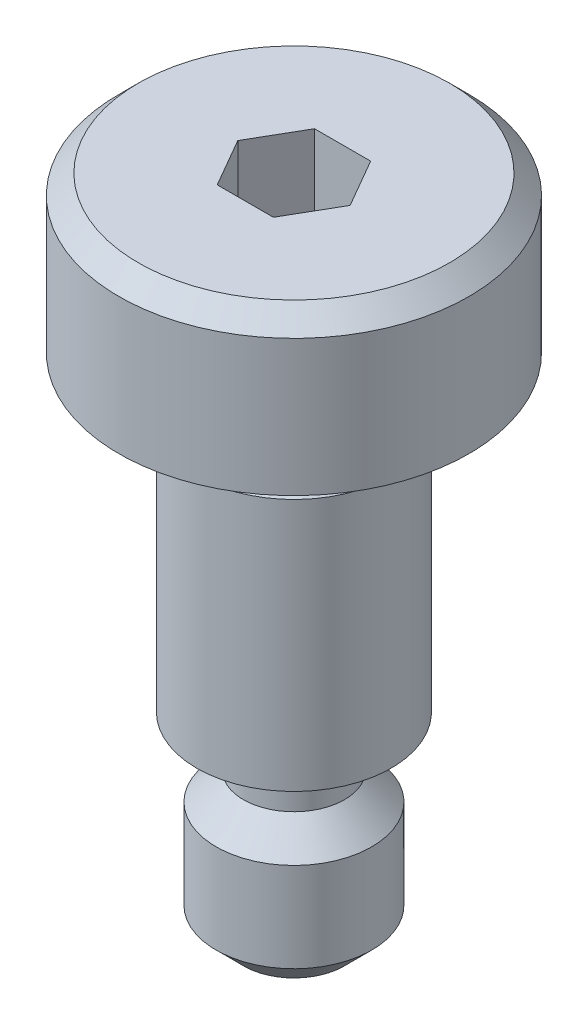
ISO-10303-21;
HEADER;
FILE_DESCRIPTION(('STEP AP214'),'2;1');
FILE_NAME('part.step','',(''),(''),'','','');
FILE_SCHEMA(('AUTOMOTIVE_DESIGN { 1 0 10303 214 1 1 1 1 }'));
ENDSEC;
DATA;
#1=APPLICATION_CONTEXT('core data for automotive mechanical design processes');
#2=APPLICATION_PROTOCOL_DEFINITION('international standard','automotive_design',2000,#1);
#3=PRODUCT_CONTEXT('',#1,'mechanical');
#4=PRODUCT('Part','Part','',(#3));
#5=PRODUCT_RELATED_PRODUCT_CATEGORY('part','',(#4));
#6=PRODUCT_DEFINITION_FORMATION('','',#4);
#7=PRODUCT_DEFINITION_CONTEXT('part definition',#1,'design');
#8=PRODUCT_DEFINITION('design','',#6,#7);
#9=PRODUCT_DEFINITION_SHAPE('','',#8);
#10=(LENGTH_UNIT() NAMED_UNIT(*) SI_UNIT(.MILLI.,.METRE.));
#11=(NAMED_UNIT(*) PLANE_ANGLE_UNIT() SI_UNIT($,.RADIAN.));
#12=(NAMED_UNIT(*) SI_UNIT($,.STERADIAN.) SOLID_ANGLE_UNIT());
#13=UNCERTAINTY_MEASURE_WITH_UNIT(LENGTH_MEASURE(1.E-05),#10,'distance_accuracy_value','');
#14=(GEOMETRIC_REPRESENTATION_CONTEXT(3) GLOBAL_UNCERTAINTY_ASSIGNED_CONTEXT((#13)) GLOBAL_UNIT_ASSIGNED_CONTEXT((#10,
#11,#12)) REPRESENTATION_CONTEXT('',''));
#15=CARTESIAN_POINT('',(0.,0.,0.));
#16=DIRECTION('',(0.,0.,1.));
#17=DIRECTION('',(1.,0.,0.));
#18=AXIS2_PLACEMENT_3D('',#15,#16,#17);
#19=CARTESIAN_POINT('',(1.3,0.,0.));
#20=DIRECTION('',(0.,-1.,0.));
#21=DIRECTION('',(0.,0.,-1.));
#22=AXIS2_PLACEMENT_3D('',#19,#20,#21);
#23=PLANE('',#22);
#24=CARTESIAN_POINT('',(0.,0.,0.));
#25=DIRECTION('',(0.,-1.,0.));
#26=DIRECTION('',(0.,0.,-1.));
#27=AXIS2_PLACEMENT_3D('',#24,#25,#26);
#28=CIRCLE('',#27,1.3);
#29=CARTESIAN_POINT('',(0.,0.,-1.3));
#30=VERTEX_POINT('',#29);
#31=EDGE_CURVE('E11',#30,#30,#28,.T.);
#32=ORIENTED_EDGE('',*,*,#31,.T.);
#33=EDGE_LOOP('',(#32));
#34=FACE_BOUND('',#33,.T.);
#35=ADVANCED_FACE('F34',(#34),#23,.T.);
#36=CARTESIAN_POINT('',(0.,0.,0.));
#37=DIRECTION('',(0.,1.,0.));
#38=DIRECTION('',(0.,0.,1.));
#39=AXIS2_PLACEMENT_3D('',#36,#37,#38);
#40=CONICAL_SURFACE('',#39,1.3,0.78539816339745);
#41=CARTESIAN_POINT('',(0.,0.699999999999997,0.));
#42=DIRECTION('',(0.,-1.,0.));
#43=DIRECTION('',(0.,0.,-1.));
#44=AXIS2_PLACEMENT_3D('',#41,#42,#43);
#45=CIRCLE('',#44,2.);
#46=CARTESIAN_POINT('',(0.,0.699999999999997,-2.));
#47=VERTEX_POINT('',#46);
#48=EDGE_CURVE('E41',#47,#47,#45,.T.);
#49=ORIENTED_EDGE('',*,*,#48,.T.);
#50=EDGE_LOOP('',(#49));
#51=FACE_BOUND('',#50,.T.);
#52=ORIENTED_EDGE('',*,*,#31,.F.);
#53=EDGE_LOOP('',(#52));
#54=FACE_BOUND('',#53,.T.);
#55=ADVANCED_FACE('F178',(#51,#54),#40,.T.);
#56=CARTESIAN_POINT('',(0.,0.,0.));
#57=DIRECTION('',(0.,-1.,0.));
#58=DIRECTION('',(0.,0.,-1.));
#59=AXIS2_PLACEMENT_3D('',#56,#57,#58);
#60=CYLINDRICAL_SURFACE('',#59,2.);
#61=CARTESIAN_POINT('',(0.,3.,0.));
#62=DIRECTION('',(0.,-1.,0.));
#63=DIRECTION('',(0.,0.,-1.));
#64=AXIS2_PLACEMENT_3D('',#61,#62,#63);
#65=CIRCLE('',#64,2.);
#66=CARTESIAN_POINT('',(0.,3.,-2.));
#67=VERTEX_POINT('',#66);
#68=EDGE_CURVE('E173',#67,#67,#65,.T.);
#69=ORIENTED_EDGE('',*,*,#68,.T.);
#70=EDGE_LOOP('',(#69));
#71=FACE_BOUND('',#70,.T.);
#72=ORIENTED_EDGE('',*,*,#48,.F.);
#73=EDGE_LOOP('',(#72));
#74=FACE_BOUND('',#73,.T.);
#75=ADVANCED_FACE('F181',(#71,#74),#60,.T.);
#76=CARTESIAN_POINT('',(0.,3.,0.));
#77=DIRECTION('',(0.,-1.,0.));
#78=DIRECTION('',(0.,0.,-1.));
#79=AXIS2_PLACEMENT_3D('',#76,#77,#78);
#80=CONICAL_SURFACE('',#79,2.,0.785398163397445);
#81=CARTESIAN_POINT('',(0.,3.7,0.));
#82=DIRECTION('',(0.,-1.,0.));
#83=DIRECTION('',(0.,0.,-1.));
#84=AXIS2_PLACEMENT_3D('',#81,#82,#83);
#85=CIRCLE('',#84,1.3);
#86=CARTESIAN_POINT('',(0.,3.7,-1.3));
#87=VERTEX_POINT('',#86);
#88=EDGE_CURVE('E170',#87,#87,#85,.T.);
#89=ORIENTED_EDGE('',*,*,#88,.T.);
#90=EDGE_LOOP('',(#89));
#91=FACE_BOUND('',#90,.T.);
#92=ORIENTED_EDGE('',*,*,#68,.F.);
#93=EDGE_LOOP('',(#92));
#94=FACE_BOUND('',#93,.T.);
#95=ADVANCED_FACE('F183',(#91,#94),#80,.T.);
#96=CARTESIAN_POINT('',(0.,0.,0.));
#97=DIRECTION('',(0.,-1.,0.));
#98=DIRECTION('',(0.,0.,-1.));
#99=AXIS2_PLACEMENT_3D('',#96,#97,#98);
#100=CYLINDRICAL_SURFACE('',#99,1.3);
#101=CARTESIAN_POINT('',(0.,4.3,0.));
#102=DIRECTION('',(0.,-1.,0.));
#103=DIRECTION('',(0.,0.,-1.));
#104=AXIS2_PLACEMENT_3D('',#101,#102,#103);
#105=CIRCLE('',#104,1.3);
#106=CARTESIAN_POINT('',(0.,4.3,-1.3));
#107=VERTEX_POINT('',#106);
#108=EDGE_CURVE('E167',#107,#107,#105,.T.);
#109=ORIENTED_EDGE('',*,*,#108,.T.);
#110=EDGE_LOOP('',(#109));
#111=FACE_BOUND('',#110,.T.);
#112=ORIENTED_EDGE('',*,*,#88,.F.);
#113=EDGE_LOOP('',(#112));
#114=FACE_BOUND('',#113,.T.);
#115=ADVANCED_FACE('F190',(#111,#114),#100,.T.);
#116=CARTESIAN_POINT('',(0.,4.3,0.));
#117=DIRECTION('',(0.,-1.,0.));
#118=DIRECTION('',(0.,0.,-1.));
#119=AXIS2_PLACEMENT_3D('',#116,#117,#118);
#120=TOROIDAL_SURFACE('',#119,2.,0.7);
#121=CARTESIAN_POINT('',(0.,5.,0.));
#122=DIRECTION('',(0.,-1.,0.));
#123=DIRECTION('',(0.,0.,-1.));
#124=AXIS2_PLACEMENT_3D('',#121,#122,#123);
#125=CIRCLE('',#124,2.);
#126=CARTESIAN_POINT('',(0.,5.,-2.));
#127=VERTEX_POINT('',#126);
#128=EDGE_CURVE('E164',#127,#127,#125,.T.);
#129=ORIENTED_EDGE('',*,*,#128,.T.);
#130=EDGE_LOOP('',(#129));
#131=FACE_BOUND('',#130,.T.);
#132=ORIENTED_EDGE('',*,*,#108,.F.);
#133=EDGE_LOOP('',(#132));
#134=FACE_BOUND('',#133,.T.);
#135=ADVANCED_FACE('F221',(#131,#134),#120,.F.);
#136=CARTESIAN_POINT('',(2.5,5.,0.));
#137=DIRECTION('',(0.,-1.,0.));
#138=DIRECTION('',(0.,0.,-1.));
#139=AXIS2_PLACEMENT_3D('',#136,#137,#138);
#140=PLANE('',#139);
#141=CARTESIAN_POINT('',(0.,5.,0.));
#142=DIRECTION('',(0.,-1.,0.));
#143=DIRECTION('',(0.,0.,-1.));
#144=AXIS2_PLACEMENT_3D('',#141,#142,#143);
#145=CIRCLE('',#144,2.5);
#146=CARTESIAN_POINT('',(0.,5.,-2.5));
#147=VERTEX_POINT('',#146);
#148=EDGE_CURVE('E161',#147,#147,#145,.T.);
#149=ORIENTED_EDGE('',*,*,#148,.T.);
#150=EDGE_LOOP('',(#149));
#151=FACE_BOUND('',#150,.T.);
#152=ORIENTED_EDGE('',*,*,#128,.F.);
#153=EDGE_LOOP('',(#152));
#154=FACE_BOUND('',#153,.T.);
#155=ADVANCED_FACE('F231',(#151,#154),#140,.T.);
#156=CARTESIAN_POINT('',(0.,0.,0.));
#157=DIRECTION('',(0.,-1.,0.));
#158=DIRECTION('',(0.,0.,-1.));
#159=AXIS2_PLACEMENT_3D('',#156,#157,#158);
#160=CYLINDRICAL_SURFACE('',#159,2.5);
#161=CARTESIAN_POINT('',(0.,11.5,0.));
#162=DIRECTION('',(0.,-1.,0.));
#163=DIRECTION('',(0.,0.,-1.));
#164=AXIS2_PLACEMENT_3D('',#161,#162,#163);
#165=CIRCLE('',#164,2.5);
#166=CARTESIAN_POINT('',(0.,11.5,-2.5));
#167=VERTEX_POINT('',#166);
#168=EDGE_CURVE('E158',#167,#167,#165,.T.);
#169=ORIENTED_EDGE('',*,*,#168,.T.);
#170=EDGE_LOOP('',(#169));
#171=FACE_BOUND('',#170,.T.);
#172=ORIENTED_EDGE('',*,*,#148,.F.);
#173=EDGE_LOOP('',(#172));
#174=FACE_BOUND('',#173,.T.);
#175=ADVANCED_FACE('F241',(#171,#174),#160,.T.);
#176=CARTESIAN_POINT('',(0.,11.5,0.));
#177=DIRECTION('',(0.,-1.,0.));
#178=DIRECTION('',(0.,0.,-1.));
#179=AXIS2_PLACEMENT_3D('',#176,#177,#178);
#180=CONICAL_SURFACE('',#179,2.5,0.785398163397445);
#181=CARTESIAN_POINT('',(0.,12.,0.));
#182=DIRECTION('',(0.,-1.,0.));
#183=DIRECTION('',(0.,0.,-1.));
#184=AXIS2_PLACEMENT_3D('',#181,#182,#183);
#185=CIRCLE('',#184,2.);
#186=CARTESIAN_POINT('',(0.,12.,-2.));
#187=VERTEX_POINT('',#186);
#188=EDGE_CURVE('E155',#187,#187,#185,.T.);
#189=ORIENTED_EDGE('',*,*,#188,.T.);
#190=EDGE_LOOP('',(#189));
#191=FACE_BOUND('',#190,.T.);
#192=ORIENTED_EDGE('',*,*,#168,.F.);
#193=EDGE_LOOP('',(#192));
#194=FACE_BOUND('',#193,.T.);
#195=ADVANCED_FACE('F251',(#191,#194),#180,.T.);
#196=CARTESIAN_POINT('',(0.,0.,0.));
#197=DIRECTION('',(0.,-1.,0.));
#198=DIRECTION('',(0.,0.,-1.));
#199=AXIS2_PLACEMENT_3D('',#196,#197,#198);
#200=CYLINDRICAL_SURFACE('',#199,2.);
#201=CARTESIAN_POINT('',(0.,12.5,0.));
#202=DIRECTION('',(0.,-1.,0.));
#203=DIRECTION('',(0.,0.,-1.));
#204=AXIS2_PLACEMENT_3D('',#201,#202,#203);
#205=CIRCLE('',#204,2.);
#206=CARTESIAN_POINT('',(0.,12.5,-2.));
#207=VERTEX_POINT('',#206);
#208=EDGE_CURVE('E152',#207,#207,#205,.T.);
#209=ORIENTED_EDGE('',*,*,#208,.T.);
#210=EDGE_LOOP('',(#209));
#211=FACE_BOUND('',#210,.T.);
#212=ORIENTED_EDGE('',*,*,#188,.F.);
#213=EDGE_LOOP('',(#212));
#214=FACE_BOUND('',#213,.T.);
#215=ADVANCED_FACE('F261',(#211,#214),#200,.T.);
#216=CARTESIAN_POINT('',(0.,12.5,0.));
#217=DIRECTION('',(0.,-1.,0.));
#218=DIRECTION('',(0.,0.,-1.));
#219=AXIS2_PLACEMENT_3D('',#216,#217,#218);
#220=TOROIDAL_SURFACE('',#219,2.5,0.5);
#221=CARTESIAN_POINT('',(0.,13.,0.));
#222=DIRECTION('',(0.,-1.,0.));
#223=DIRECTION('',(0.,0.,-1.));
#224=AXIS2_PLACEMENT_3D('',#221,#222,#223);
#225=CIRCLE('',#224,2.5);
#226=CARTESIAN_POINT('',(0.,13.,-2.5));
#227=VERTEX_POINT('',#226);
#228=EDGE_CURVE('E149',#227,#227,#225,.T.);
#229=ORIENTED_EDGE('',*,*,#228,.T.);
#230=EDGE_LOOP('',(#229));
#231=FACE_BOUND('',#230,.T.);
#232=ORIENTED_EDGE('',*,*,#208,.F.);
#233=EDGE_LOOP('',(#232));
#234=FACE_BOUND('',#233,.T.);
#235=ADVANCED_FACE('F271',(#231,#234),#220,.F.);
#236=CARTESIAN_POINT('',(4.5,13.,0.));
#237=DIRECTION('',(0.,-1.,0.));
#238=DIRECTION('',(0.,0.,-1.));
#239=AXIS2_PLACEMENT_3D('',#236,#237,#238);
#240=PLANE('',#239);
#241=CARTESIAN_POINT('',(0.,13.,0.));
#242=DIRECTION('',(0.,-1.,0.));
#243=DIRECTION('',(0.,0.,-1.));
#244=AXIS2_PLACEMENT_3D('',#241,#242,#243);
#245=CIRCLE('',#244,4.5);
#246=CARTESIAN_POINT('',(0.,13.,-4.5));
#247=VERTEX_POINT('',#246);
#248=EDGE_CURVE('E146',#247,#247,#245,.T.);
#249=ORIENTED_EDGE('',*,*,#248,.T.);
#250=EDGE_LOOP('',(#249));
#251=FACE_BOUND('',#250,.T.);
#252=ORIENTED_EDGE('',*,*,#228,.F.);
#253=EDGE_LOOP('',(#252));
#254=FACE_BOUND('',#253,.T.);
#255=ADVANCED_FACE('F281',(#251,#254),#240,.T.);
#256=CARTESIAN_POINT('',(0.,0.,0.));
#257=DIRECTION('',(0.,-1.,0.));
#258=DIRECTION('',(0.,0.,-1.));
#259=AXIS2_PLACEMENT_3D('',#256,#257,#258);
#260=CYLINDRICAL_SURFACE('',#259,4.5);
#261=CARTESIAN_POINT('',(0.,16.5,0.));
#262=DIRECTION('',(0.,-1.,0.));
#263=DIRECTION('',(0.,0.,-1.));
#264=AXIS2_PLACEMENT_3D('',#261,#262,#263);
#265=CIRCLE('',#264,4.5);
#266=CARTESIAN_POINT('',(0.,16.5,-4.5));
#267=VERTEX_POINT('',#266);
#268=EDGE_CURVE('E143',#267,#267,#265,.T.);
#269=ORIENTED_EDGE('',*,*,#268,.T.);
#270=EDGE_LOOP('',(#269));
#271=FACE_BOUND('',#270,.T.);
#272=ORIENTED_EDGE('',*,*,#248,.F.);
#273=EDGE_LOOP('',(#272));
#274=FACE_BOUND('',#273,.T.);
#275=ADVANCED_FACE('F291',(#271,#274),#260,.T.);
#276=CARTESIAN_POINT('',(0.,16.5,0.));
#277=DIRECTION('',(0.,-1.,0.));
#278=DIRECTION('',(0.,0.,-1.));
#279=AXIS2_PLACEMENT_3D('',#276,#277,#278);
#280=CONICAL_SURFACE('',#279,4.5,0.785398163397446);
#281=CARTESIAN_POINT('',(0.,17.,0.));
#282=DIRECTION('',(0.,-1.,0.));
#283=DIRECTION('',(0.,0.,-1.));
#284=AXIS2_PLACEMENT_3D('',#281,#282,#283);
#285=CIRCLE('',#284,4.);
#286=CARTESIAN_POINT('',(0.,17.,-4.));
#287=VERTEX_POINT('',#286);
#288=EDGE_CURVE('E135',#287,#287,#285,.T.);
#289=ORIENTED_EDGE('',*,*,#288,.T.);
#290=EDGE_LOOP('',(#289));
#291=FACE_BOUND('',#290,.T.);
#292=ORIENTED_EDGE('',*,*,#268,.F.);
#293=EDGE_LOOP('',(#292));
#294=FACE_BOUND('',#293,.T.);
#295=ADVANCED_FACE('F301',(#291,#294),#280,.T.);
#296=CARTESIAN_POINT('',(0.,17.,0.));
#297=DIRECTION('',(0.,1.,0.));
#298=DIRECTION('',(0.,0.,1.));
#299=AXIS2_PLACEMENT_3D('',#296,#297,#298);
#300=PLANE('',#299);
#301=DIRECTION('',(-0.5,0.,-0.866025403784438));
#302=VECTOR('',#301,1.);
#303=CARTESIAN_POINT('',(1.44337567297406,17.,0.));
#304=LINE('',#303,#302);
#305=CARTESIAN_POINT('',(1.44337567297406,17.,0.));
#306=VERTEX_POINT('',#305);
#307=CARTESIAN_POINT('',(0.721687836487032,17.,-1.25));
#308=VERTEX_POINT('',#307);
#309=EDGE_CURVE('E48',#306,#308,#304,.T.);
#310=ORIENTED_EDGE('',*,*,#309,.F.);
#311=DIRECTION('',(0.5,0.,-0.866025403784438));
#312=VECTOR('',#311,1.);
#313=CARTESIAN_POINT('',(0.721687836487032,17.,1.25));
#314=LINE('',#313,#312);
#315=CARTESIAN_POINT('',(0.721687836487032,17.,1.25));
#316=VERTEX_POINT('',#315);
#317=EDGE_CURVE('E131',#316,#306,#314,.T.);
#318=ORIENTED_EDGE('',*,*,#317,.F.);
#319=DIRECTION('',(1.,0.,0.));
#320=VECTOR('',#319,1.);
#321=CARTESIAN_POINT('',(-0.721687836487032,17.,1.25));
#322=LINE('',#321,#320);
#323=CARTESIAN_POINT('',(-0.721687836487032,17.,1.25));
#324=VERTEX_POINT('',#323);
#325=EDGE_CURVE('E129',#324,#316,#322,.T.);
#326=ORIENTED_EDGE('',*,*,#325,.F.);
#327=DIRECTION('',(0.5,0.,0.866025403784439));
#328=VECTOR('',#327,1.);
#329=CARTESIAN_POINT('',(-1.44337567297406,17.,0.));
#330=LINE('',#329,#328);
#331=CARTESIAN_POINT('',(-1.44337567297406,17.,0.));
#332=VERTEX_POINT('',#331);
#333=EDGE_CURVE('E96',#332,#324,#330,.T.);
#334=ORIENTED_EDGE('',*,*,#333,.F.);
#335=DIRECTION('',(-0.5,0.,0.866025403784439));
#336=VECTOR('',#335,1.);
#337=CARTESIAN_POINT('',(-0.721687836487032,17.,-1.25));
#338=LINE('',#337,#336);
#339=CARTESIAN_POINT('',(-0.721687836487032,17.,-1.25));
#340=VERTEX_POINT('',#339);
#341=EDGE_CURVE('E125',#340,#332,#338,.T.);
#342=ORIENTED_EDGE('',*,*,#341,.F.);
#343=DIRECTION('',(-1.,0.,0.));
#344=VECTOR('',#343,1.);
#345=CARTESIAN_POINT('',(0.721687836487032,17.,-1.25));
#346=LINE('',#345,#344);
#347=EDGE_CURVE('E122',#308,#340,#346,.T.);
#348=ORIENTED_EDGE('',*,*,#347,.F.);
#349=EDGE_LOOP('',(#310,#318,#326,#334,#342,#348));
#350=FACE_BOUND('',#349,.T.);
#351=ORIENTED_EDGE('',*,*,#288,.F.);
#352=EDGE_LOOP('',(#351));
#353=FACE_BOUND('',#352,.T.);
#354=ADVANCED_FACE('F311',(#350,#353),#300,.T.);
#355=CARTESIAN_POINT('',(1.44337567297406,14.,0.));
#356=DIRECTION('',(0.866025403784439,0.,-0.5));
#357=DIRECTION('',(-0.5,0.,-0.866025403784439));
#358=AXIS2_PLACEMENT_3D('',#355,#356,#357);
#359=PLANE('',#358);
#360=ORIENTED_EDGE('',*,*,#309,.T.);
#361=DIRECTION('',(0.,1.,0.));
#362=VECTOR('',#361,1.);
#363=CARTESIAN_POINT('',(0.721687836487032,14.,-1.25));
#364=LINE('',#363,#362);
#365=CARTESIAN_POINT('',(0.721687836487032,14.,-1.25));
#366=VERTEX_POINT('',#365);
#367=EDGE_CURVE('E78',#366,#308,#364,.T.);
#368=ORIENTED_EDGE('',*,*,#367,.F.);
#369=DIRECTION('',(-0.5,0.,-0.866025403784438));
#370=VECTOR('',#369,1.);
#371=CARTESIAN_POINT('',(1.44337567297406,14.,0.));
#372=LINE('',#371,#370);
#373=CARTESIAN_POINT('',(1.44337567297406,14.,0.));
#374=VERTEX_POINT('',#373);
#375=EDGE_CURVE('E133',#374,#366,#372,.T.);
#376=ORIENTED_EDGE('',*,*,#375,.F.);
#377=DIRECTION('',(0.,1.,0.));
#378=VECTOR('',#377,1.);
#379=CARTESIAN_POINT('',(1.44337567297406,14.,0.));
#380=LINE('',#379,#378);
#381=EDGE_CURVE('E56',#374,#306,#380,.T.);
#382=ORIENTED_EDGE('',*,*,#381,.T.);
#383=EDGE_LOOP('',(#360,#368,#376,#382));
#384=FACE_BOUND('',#383,.T.);
#385=ADVANCED_FACE('F321',(#384),#359,.F.);
#386=CARTESIAN_POINT('',(0.721687836487032,14.,1.25));
#387=DIRECTION('',(0.866025403784439,0.,0.5));
#388=DIRECTION('',(0.5,0.,-0.866025403784439));
#389=AXIS2_PLACEMENT_3D('',#386,#387,#388);
#390=PLANE('',#389);
#391=ORIENTED_EDGE('',*,*,#317,.T.);
#392=ORIENTED_EDGE('',*,*,#381,.F.);
#393=DIRECTION('',(0.5,0.,-0.866025403784438));
#394=VECTOR('',#393,1.);
#395=CARTESIAN_POINT('',(0.721687836487032,14.,1.25));
#396=LINE('',#395,#394);
#397=CARTESIAN_POINT('',(0.721687836487032,14.,1.25));
#398=VERTEX_POINT('',#397);
#399=EDGE_CURVE('E108',#398,#374,#396,.T.);
#400=ORIENTED_EDGE('',*,*,#399,.F.);
#401=DIRECTION('',(0.,1.,0.));
#402=VECTOR('',#401,1.);
#403=CARTESIAN_POINT('',(0.721687836487032,14.,1.25));
#404=LINE('',#403,#402);
#405=EDGE_CURVE('E100',#398,#316,#404,.T.);
#406=ORIENTED_EDGE('',*,*,#405,.T.);
#407=EDGE_LOOP('',(#391,#392,#400,#406));
#408=FACE_BOUND('',#407,.T.);
#409=ADVANCED_FACE('F331',(#408),#390,.F.);
#410=CARTESIAN_POINT('',(-0.721687836487032,14.,1.25));
#411=DIRECTION('',(0.,0.,1.));
#412=DIRECTION('',(1.,0.,0.));
#413=AXIS2_PLACEMENT_3D('',#410,#411,#412);
#414=PLANE('',#413);
#415=ORIENTED_EDGE('',*,*,#325,.T.);
#416=ORIENTED_EDGE('',*,*,#405,.F.);
#417=DIRECTION('',(1.,0.,0.));
#418=VECTOR('',#417,1.);
#419=CARTESIAN_POINT('',(-0.721687836487032,14.,1.25));
#420=LINE('',#419,#418);
#421=CARTESIAN_POINT('',(-0.721687836487032,14.,1.25));
#422=VERTEX_POINT('',#421);
#423=EDGE_CURVE('E104',#422,#398,#420,.T.);
#424=ORIENTED_EDGE('',*,*,#423,.F.);
#425=DIRECTION('',(0.,1.,0.));
#426=VECTOR('',#425,1.);
#427=CARTESIAN_POINT('',(-0.721687836487032,14.,1.25));
#428=LINE('',#427,#426);
#429=EDGE_CURVE('E89',#422,#324,#428,.T.);
#430=ORIENTED_EDGE('',*,*,#429,.T.);
#431=EDGE_LOOP('',(#415,#416,#424,#430));
#432=FACE_BOUND('',#431,.T.);
#433=ADVANCED_FACE('F105',(#432),#414,.F.);
#434=CARTESIAN_POINT('',(-1.44337567297406,14.,0.));
#435=DIRECTION('',(-0.866025403784438,0.,0.5));
#436=DIRECTION('',(0.5,0.,0.866025403784439));
#437=AXIS2_PLACEMENT_3D('',#434,#435,#436);
#438=PLANE('',#437);
#439=ORIENTED_EDGE('',*,*,#333,.T.);
#440=ORIENTED_EDGE('',*,*,#429,.F.);
#441=DIRECTION('',(0.5,0.,0.866025403784439));
#442=VECTOR('',#441,1.);
#443=CARTESIAN_POINT('',(-1.44337567297406,14.,0.));
#444=LINE('',#443,#442);
#445=CARTESIAN_POINT('',(-1.44337567297406,14.,0.));
#446=VERTEX_POINT('',#445);
#447=EDGE_CURVE('E93',#446,#422,#444,.T.);
#448=ORIENTED_EDGE('',*,*,#447,.F.);
#449=DIRECTION('',(0.,1.,0.));
#450=VECTOR('',#449,1.);
#451=CARTESIAN_POINT('',(-1.44337567297406,14.,0.));
#452=LINE('',#451,#450);
#453=EDGE_CURVE('E101',#446,#332,#452,.T.);
#454=ORIENTED_EDGE('',*,*,#453,.T.);
#455=EDGE_LOOP('',(#439,#440,#448,#454));
#456=FACE_BOUND('',#455,.T.);
#457=ADVANCED_FACE('F91',(#456),#438,.F.);
#458=CARTESIAN_POINT('',(-0.721687836487032,14.,-1.25));
#459=DIRECTION('',(-0.866025403784438,0.,-0.5));
#460=DIRECTION('',(-0.5,0.,0.866025403784439));
#461=AXIS2_PLACEMENT_3D('',#458,#459,#460);
#462=PLANE('',#461);
#463=ORIENTED_EDGE('',*,*,#341,.T.);
#464=ORIENTED_EDGE('',*,*,#453,.F.);
#465=DIRECTION('',(-0.5,0.,0.866025403784439));
#466=VECTOR('',#465,1.);
#467=CARTESIAN_POINT('',(-0.721687836487032,14.,-1.25));
#468=LINE('',#467,#466);
#469=CARTESIAN_POINT('',(-0.721687836487032,14.,-1.25));
#470=VERTEX_POINT('',#469);
#471=EDGE_CURVE('E114',#470,#446,#468,.T.);
#472=ORIENTED_EDGE('',*,*,#471,.F.);
#473=DIRECTION('',(0.,1.,0.));
#474=VECTOR('',#473,1.);
#475=CARTESIAN_POINT('',(-0.721687836487032,14.,-1.25));
#476=LINE('',#475,#474);
#477=EDGE_CURVE('E138',#470,#340,#476,.T.);
#478=ORIENTED_EDGE('',*,*,#477,.T.);
#479=EDGE_LOOP('',(#463,#464,#472,#478));
#480=FACE_BOUND('',#479,.T.);
#481=ADVANCED_FACE('F356',(#480),#462,.F.);
#482=CARTESIAN_POINT('',(0.721687836487032,14.,-1.25));
#483=DIRECTION('',(0.,0.,-1.));
#484=DIRECTION('',(-1.,0.,0.));
#485=AXIS2_PLACEMENT_3D('',#482,#483,#484);
#486=PLANE('',#485);
#487=ORIENTED_EDGE('',*,*,#347,.T.);
#488=ORIENTED_EDGE('',*,*,#477,.F.);
#489=DIRECTION('',(-1.,0.,0.));
#490=VECTOR('',#489,1.);
#491=CARTESIAN_POINT('',(0.721687836487032,14.,-1.25));
#492=LINE('',#491,#490);
#493=EDGE_CURVE('E116',#366,#470,#492,.T.);
#494=ORIENTED_EDGE('',*,*,#493,.F.);
#495=ORIENTED_EDGE('',*,*,#367,.T.);
#496=EDGE_LOOP('',(#487,#488,#494,#495));
#497=FACE_BOUND('',#496,.T.);
#498=ADVANCED_FACE('F365',(#497),#486,.F.);
#499=CARTESIAN_POINT('',(0.,14.,0.));
#500=DIRECTION('',(0.,1.,0.));
#501=DIRECTION('',(0.,0.,1.));
#502=AXIS2_PLACEMENT_3D('',#499,#500,#501);
#503=PLANE('',#502);
#504=ORIENTED_EDGE('',*,*,#375,.T.);
#505=ORIENTED_EDGE('',*,*,#493,.T.);
#506=ORIENTED_EDGE('',*,*,#471,.T.);
#507=ORIENTED_EDGE('',*,*,#447,.T.);
#508=ORIENTED_EDGE('',*,*,#423,.T.);
#509=ORIENTED_EDGE('',*,*,#399,.T.);
#510=EDGE_LOOP('',(#504,#505,#506,#507,#508,#509));
#511=FACE_BOUND('',#510,.T.);
#512=ADVANCED_FACE('F111',(#511),#503,.T.);
#513=CLOSED_SHELL('',(#35,#55,#75,#95,#115,#135,#155,#175,#195,#215,#235,#255,#275,#295,#354,
#385,#409,#433,#457,#481,#498,#512));
#514=MANIFOLD_SOLID_BREP('B2',#513);
#515=ADVANCED_BREP_SHAPE_REPRESENTATION('',(#18,#514),#14);
#516=SHAPE_DEFINITION_REPRESENTATION(#9,#515);
ENDSEC;
END-ISO-10303-21;
